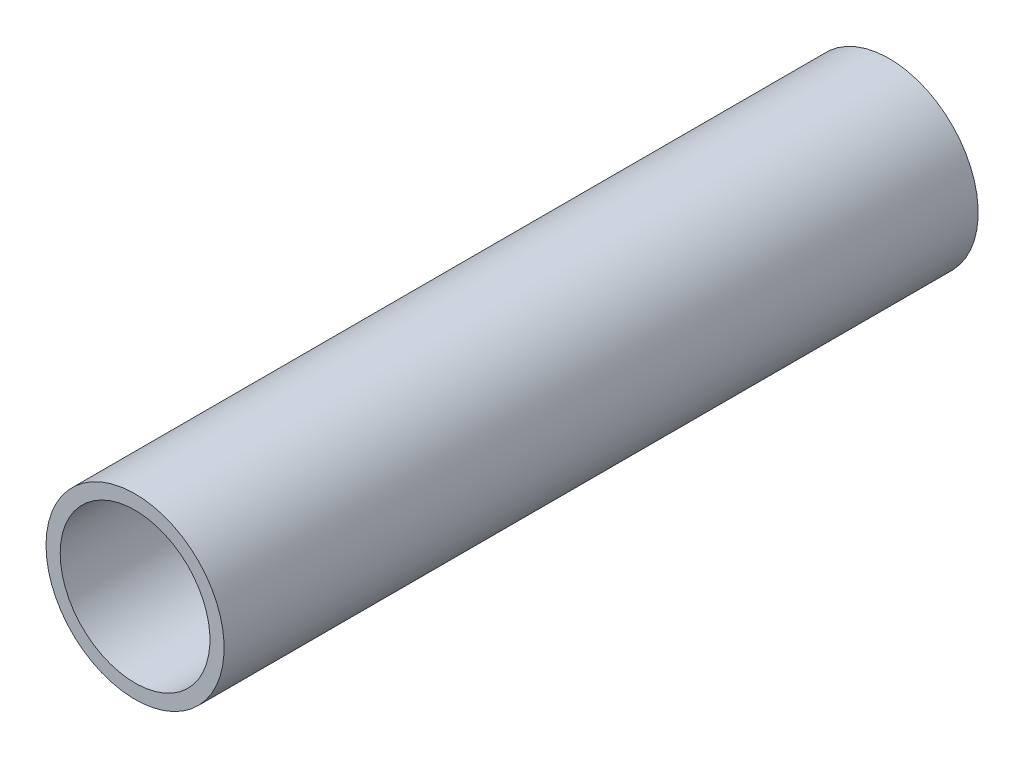
ISO-10303-21;
HEADER;
FILE_DESCRIPTION(('STEP AP214'),'2;1');
FILE_NAME('part.step','',(''),(''),'','','');
FILE_SCHEMA(('AUTOMOTIVE_DESIGN { 1 0 10303 214 1 1 1 1 }'));
ENDSEC;
DATA;
#1=APPLICATION_CONTEXT('core data for automotive mechanical design processes');
#2=APPLICATION_PROTOCOL_DEFINITION('international standard','automotive_design',2000,#1);
#3=PRODUCT_CONTEXT('',#1,'mechanical');
#4=PRODUCT('Part','Part','',(#3));
#5=PRODUCT_RELATED_PRODUCT_CATEGORY('part','',(#4));
#6=PRODUCT_DEFINITION_FORMATION('','',#4);
#7=PRODUCT_DEFINITION_CONTEXT('part definition',#1,'design');
#8=PRODUCT_DEFINITION('design','',#6,#7);
#9=PRODUCT_DEFINITION_SHAPE('','',#8);
#10=(LENGTH_UNIT() NAMED_UNIT(*) SI_UNIT(.MILLI.,.METRE.));
#11=(NAMED_UNIT(*) PLANE_ANGLE_UNIT() SI_UNIT($,.RADIAN.));
#12=(NAMED_UNIT(*) SI_UNIT($,.STERADIAN.) SOLID_ANGLE_UNIT());
#13=UNCERTAINTY_MEASURE_WITH_UNIT(LENGTH_MEASURE(1.E-05),#10,'distance_accuracy_value','');
#14=(GEOMETRIC_REPRESENTATION_CONTEXT(3) GLOBAL_UNCERTAINTY_ASSIGNED_CONTEXT((#13)) GLOBAL_UNIT_ASSIGNED_CONTEXT((#10,
#11,#12)) REPRESENTATION_CONTEXT('',''));
#15=CARTESIAN_POINT('',(0.,0.,0.));
#16=DIRECTION('',(0.,0.,1.));
#17=DIRECTION('',(1.,0.,0.));
#18=AXIS2_PLACEMENT_3D('',#15,#16,#17);
#19=CARTESIAN_POINT('',(0.,0.,40.48125));
#20=DIRECTION('',(0.,0.,-1.));
#21=DIRECTION('',(-1.,0.,0.));
#22=AXIS2_PLACEMENT_3D('',#19,#20,#21);
#23=CYLINDRICAL_SURFACE('',#22,8.0391);
#24=CARTESIAN_POINT('',(0.,0.,-40.48125));
#25=DIRECTION('',(0.,0.,-1.));
#26=DIRECTION('',(-1.,0.,0.));
#27=AXIS2_PLACEMENT_3D('',#24,#25,#26);
#28=CIRCLE('',#27,8.0391);
#29=CARTESIAN_POINT('',(-8.0391,0.,-40.48125));
#30=VERTEX_POINT('',#29);
#31=EDGE_CURVE('E28',#30,#30,#28,.T.);
#32=ORIENTED_EDGE('',*,*,#31,.T.);
#33=EDGE_LOOP('',(#32));
#34=FACE_BOUND('',#33,.T.);
#35=CARTESIAN_POINT('',(0.,0.,40.48125));
#36=DIRECTION('',(0.,0.,-1.));
#37=DIRECTION('',(-1.,0.,0.));
#38=AXIS2_PLACEMENT_3D('',#35,#36,#37);
#39=CIRCLE('',#38,8.0391);
#40=CARTESIAN_POINT('',(-8.0391,0.,40.48125));
#41=VERTEX_POINT('',#40);
#42=EDGE_CURVE('E19',#41,#41,#39,.T.);
#43=ORIENTED_EDGE('',*,*,#42,.F.);
#44=EDGE_LOOP('',(#43));
#45=FACE_BOUND('',#44,.T.);
#46=ADVANCED_FACE('F16',(#34,#45),#23,.F.);
#47=CARTESIAN_POINT('',(0.,0.,40.48125));
#48=DIRECTION('',(0.,0.,1.));
#49=DIRECTION('',(1.,0.,0.));
#50=AXIS2_PLACEMENT_3D('',#47,#48,#49);
#51=PLANE('',#50);
#52=ORIENTED_EDGE('',*,*,#42,.T.);
#53=EDGE_LOOP('',(#52));
#54=FACE_BOUND('',#53,.T.);
#55=CARTESIAN_POINT('',(0.,0.,40.48125));
#56=DIRECTION('',(0.,0.,-1.));
#57=DIRECTION('',(-1.,0.,0.));
#58=AXIS2_PLACEMENT_3D('',#55,#56,#57);
#59=CIRCLE('',#58,9.5631);
#60=CARTESIAN_POINT('',(-9.5631,0.,40.48125));
#61=VERTEX_POINT('',#60);
#62=EDGE_CURVE('E23',#61,#61,#59,.T.);
#63=ORIENTED_EDGE('',*,*,#62,.F.);
#64=EDGE_LOOP('',(#63));
#65=FACE_BOUND('',#64,.T.);
#66=ADVANCED_FACE('F36',(#54,#65),#51,.T.);
#67=CARTESIAN_POINT('',(0.,0.,-40.48125));
#68=DIRECTION('',(0.,0.,1.));
#69=DIRECTION('',(1.,0.,0.));
#70=AXIS2_PLACEMENT_3D('',#67,#68,#69);
#71=PLANE('',#70);
#72=ORIENTED_EDGE('',*,*,#31,.F.);
#73=EDGE_LOOP('',(#72));
#74=FACE_BOUND('',#73,.T.);
#75=CARTESIAN_POINT('',(0.,0.,-40.48125));
#76=DIRECTION('',(0.,0.,-1.));
#77=DIRECTION('',(-1.,0.,0.));
#78=AXIS2_PLACEMENT_3D('',#75,#76,#77);
#79=CIRCLE('',#78,9.5631);
#80=CARTESIAN_POINT('',(-9.5631,0.,-40.48125));
#81=VERTEX_POINT('',#80);
#82=EDGE_CURVE('E10',#81,#81,#79,.F.);
#83=ORIENTED_EDGE('',*,*,#82,.F.);
#84=EDGE_LOOP('',(#83));
#85=FACE_BOUND('',#84,.T.);
#86=ADVANCED_FACE('F43',(#74,#85),#71,.F.);
#87=CARTESIAN_POINT('',(0.,0.,40.48125));
#88=DIRECTION('',(0.,0.,-1.));
#89=DIRECTION('',(-1.,0.,0.));
#90=AXIS2_PLACEMENT_3D('',#87,#88,#89);
#91=CYLINDRICAL_SURFACE('',#90,9.5631);
#92=ORIENTED_EDGE('',*,*,#82,.T.);
#93=EDGE_LOOP('',(#92));
#94=FACE_BOUND('',#93,.T.);
#95=ORIENTED_EDGE('',*,*,#62,.T.);
#96=EDGE_LOOP('',(#95));
#97=FACE_BOUND('',#96,.T.);
#98=ADVANCED_FACE('F44',(#94,#97),#91,.T.);
#99=CLOSED_SHELL('',(#46,#66,#86,#98));
#100=MANIFOLD_SOLID_BREP('B1',#99);
#101=ADVANCED_BREP_SHAPE_REPRESENTATION('',(#18,#100),#14);
#102=SHAPE_DEFINITION_REPRESENTATION(#9,#101);
ENDSEC;
END-ISO-10303-21;
